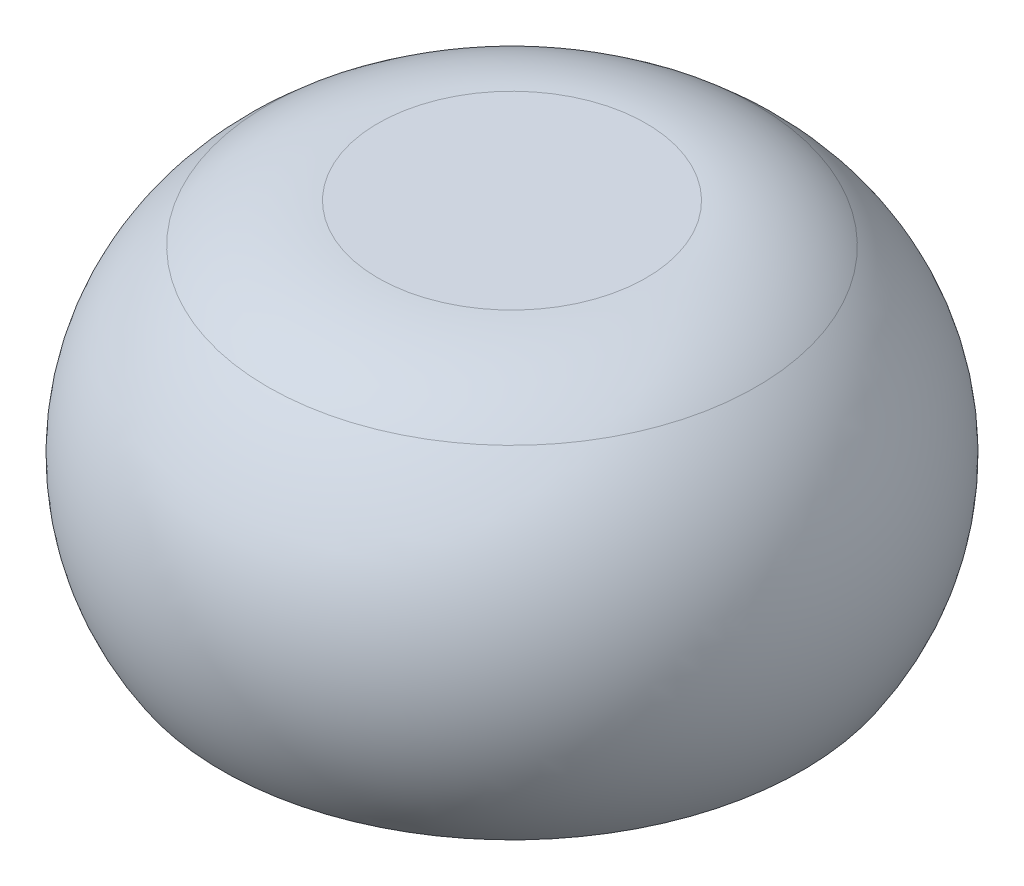
ISO-10303-21;
HEADER;
FILE_DESCRIPTION(('STEP AP214'),'2;1');
FILE_NAME('part.step','',(''),(''),'','','');
FILE_SCHEMA(('AUTOMOTIVE_DESIGN { 1 0 10303 214 1 1 1 1 }'));
ENDSEC;
DATA;
#1=APPLICATION_CONTEXT('core data for automotive mechanical design processes');
#2=APPLICATION_PROTOCOL_DEFINITION('international standard','automotive_design',2000,#1);
#3=PRODUCT_CONTEXT('',#1,'mechanical');
#4=PRODUCT('Part','Part','',(#3));
#5=PRODUCT_RELATED_PRODUCT_CATEGORY('part','',(#4));
#6=PRODUCT_DEFINITION_FORMATION('','',#4);
#7=PRODUCT_DEFINITION_CONTEXT('part definition',#1,'design');
#8=PRODUCT_DEFINITION('design','',#6,#7);
#9=PRODUCT_DEFINITION_SHAPE('','',#8);
#10=(LENGTH_UNIT() NAMED_UNIT(*) SI_UNIT(.MILLI.,.METRE.));
#11=(NAMED_UNIT(*) PLANE_ANGLE_UNIT() SI_UNIT($,.RADIAN.));
#12=(NAMED_UNIT(*) SI_UNIT($,.STERADIAN.) SOLID_ANGLE_UNIT());
#13=UNCERTAINTY_MEASURE_WITH_UNIT(LENGTH_MEASURE(1.E-05),#10,'distance_accuracy_value','');
#14=(GEOMETRIC_REPRESENTATION_CONTEXT(3) GLOBAL_UNCERTAINTY_ASSIGNED_CONTEXT((#13)) GLOBAL_UNIT_ASSIGNED_CONTEXT((#10,
#11,#12)) REPRESENTATION_CONTEXT('',''));
#15=CARTESIAN_POINT('',(0.,0.,0.));
#16=DIRECTION('',(0.,0.,1.));
#17=DIRECTION('',(1.,0.,0.));
#18=AXIS2_PLACEMENT_3D('',#15,#16,#17);
#19=CARTESIAN_POINT('',(0.,8.35391052434009,0.));
#20=DIRECTION('',(0.,-1.,0.));
#21=DIRECTION('',(0.,0.,-1.));
#22=AXIS2_PLACEMENT_3D('',#19,#20,#21);
#23=CYLINDRICAL_SURFACE('',#22,2.6);
#24=CARTESIAN_POINT('',(0.,0.7,0.));
#25=DIRECTION('',(0.,-1.,0.));
#26=DIRECTION('',(0.,0.,-1.));
#27=AXIS2_PLACEMENT_3D('',#24,#25,#26);
#28=CIRCLE('',#27,2.6);
#29=CARTESIAN_POINT('',(0.,0.7,-2.6));
#30=VERTEX_POINT('',#29);
#31=EDGE_CURVE('E12',#30,#30,#28,.F.);
#32=ORIENTED_EDGE('',*,*,#31,.F.);
#33=EDGE_LOOP('',(#32));
#34=FACE_BOUND('',#33,.T.);
#35=CARTESIAN_POINT('',(0.,0.,0.));
#36=DIRECTION('',(0.,-1.,0.));
#37=DIRECTION('',(0.,0.,-1.));
#38=AXIS2_PLACEMENT_3D('',#35,#36,#37);
#39=CIRCLE('',#38,2.6);
#40=CARTESIAN_POINT('',(0.,0.,-2.6));
#41=VERTEX_POINT('',#40);
#42=EDGE_CURVE('E52',#41,#41,#39,.T.);
#43=ORIENTED_EDGE('',*,*,#42,.F.);
#44=EDGE_LOOP('',(#43));
#45=FACE_BOUND('',#44,.T.);
#46=ADVANCED_FACE('F46',(#34,#45),#23,.T.);
#47=CARTESIAN_POINT('',(0.,0.,0.));
#48=DIRECTION('',(0.,-1.,0.));
#49=DIRECTION('',(0.,0.,-1.));
#50=AXIS2_PLACEMENT_3D('',#47,#48,#49);
#51=PLANE('',#50);
#52=ORIENTED_EDGE('',*,*,#42,.T.);
#53=EDGE_LOOP('',(#52));
#54=FACE_BOUND('',#53,.T.);
#55=ADVANCED_FACE('F58',(#54),#51,.T.);
#56=CARTESIAN_POINT('',(0.,0.7,0.));
#57=DIRECTION('',(0.,-1.,0.));
#58=DIRECTION('',(0.,0.,-1.));
#59=AXIS2_PLACEMENT_3D('',#56,#57,#58);
#60=PLANE('',#59);
#61=ORIENTED_EDGE('',*,*,#31,.T.);
#62=EDGE_LOOP('',(#61));
#63=FACE_BOUND('',#62,.T.);
#64=ADVANCED_FACE('F65',(#63),#60,.F.);
#65=CLOSED_SHELL('',(#46,#55,#64));
#66=MANIFOLD_SOLID_BREP('B2_NOT_SHOWN',#65);
#67=CARTESIAN_POINT('',(0.,0.,0.));
#68=DIRECTION('',(0.,1.,0.));
#69=DIRECTION('',(0.,0.,1.));
#70=AXIS2_PLACEMENT_3D('',#67,#68,#69);
#71=PLANE('',#70);
#72=CARTESIAN_POINT('',(0.,0.,0.));
#73=DIRECTION('',(0.,1.,0.));
#74=DIRECTION('',(0.,0.,1.));
#75=AXIS2_PLACEMENT_3D('',#72,#73,#74);
#76=CIRCLE('',#75,3.40000000000001);
#77=CARTESIAN_POINT('',(0.,0.,3.40000000000001));
#78=VERTEX_POINT('',#77);
#79=EDGE_CURVE('E162',#78,#78,#76,.T.);
#80=ORIENTED_EDGE('',*,*,#79,.T.);
#81=EDGE_LOOP('',(#80));
#82=FACE_BOUND('',#81,.T.);
#83=CARTESIAN_POINT('',(0.,0.,0.));
#84=DIRECTION('',(0.,-1.,0.));
#85=DIRECTION('',(0.,0.,-1.));
#86=AXIS2_PLACEMENT_3D('',#83,#84,#85);
#87=CIRCLE('',#86,5.);
#88=CARTESIAN_POINT('',(0.,0.,-5.));
#89=VERTEX_POINT('',#88);
#90=EDGE_CURVE('E208',#89,#89,#87,.T.);
#91=ORIENTED_EDGE('',*,*,#90,.T.);
#92=EDGE_LOOP('',(#91));
#93=FACE_BOUND('',#92,.T.);
#94=ADVANCED_FACE('F88',(#82,#93),#71,.F.);
#95=CARTESIAN_POINT('',(0.,1.,0.));
#96=DIRECTION('',(0.,-1.,0.));
#97=DIRECTION('',(0.,0.,-1.));
#98=AXIS2_PLACEMENT_3D('',#95,#96,#97);
#99=CYLINDRICAL_SURFACE('',#98,3.2);
#100=CARTESIAN_POINT('',(0.,0.200000000000004,0.));
#101=DIRECTION('',(0.,1.,0.));
#102=DIRECTION('',(0.,0.,1.));
#103=AXIS2_PLACEMENT_3D('',#100,#101,#102);
#104=CIRCLE('',#103,3.2);
#105=CARTESIAN_POINT('',(0.,0.200000000000004,3.2));
#106=VERTEX_POINT('',#105);
#107=EDGE_CURVE('E137',#106,#106,#104,.F.);
#108=ORIENTED_EDGE('',*,*,#107,.T.);
#109=EDGE_LOOP('',(#108));
#110=FACE_BOUND('',#109,.T.);
#111=CARTESIAN_POINT('',(0.,1.,0.));
#112=DIRECTION('',(0.,-1.,0.));
#113=DIRECTION('',(0.,0.,-1.));
#114=AXIS2_PLACEMENT_3D('',#111,#112,#113);
#115=CIRCLE('',#114,3.2);
#116=CARTESIAN_POINT('',(0.,1.,-3.2));
#117=VERTEX_POINT('',#116);
#118=EDGE_CURVE('E207',#117,#117,#115,.T.);
#119=ORIENTED_EDGE('',*,*,#118,.F.);
#120=EDGE_LOOP('',(#119));
#121=FACE_BOUND('',#120,.T.);
#122=ADVANCED_FACE('F181',(#110,#121),#99,.F.);
#123=CARTESIAN_POINT('',(0.,1.,0.));
#124=DIRECTION('',(0.,-1.,0.));
#125=DIRECTION('',(0.,0.,-1.));
#126=AXIS2_PLACEMENT_3D('',#123,#124,#125);
#127=PLANE('',#126);
#128=DIRECTION('',(1.,0.,0.));
#129=VECTOR('',#128,1.);
#130=CARTESIAN_POINT('',(-1.65,1.,-1.65));
#131=LINE('',#130,#129);
#132=CARTESIAN_POINT('',(-1.65,1.,-1.65));
#133=VERTEX_POINT('',#132);
#134=CARTESIAN_POINT('',(1.65,1.,-1.65));
#135=VERTEX_POINT('',#134);
#136=EDGE_CURVE('E147',#133,#135,#131,.T.);
#137=ORIENTED_EDGE('',*,*,#136,.F.);
#138=DIRECTION('',(0.,0.,-1.));
#139=VECTOR('',#138,1.);
#140=CARTESIAN_POINT('',(-1.65,1.,1.65));
#141=LINE('',#140,#139);
#142=CARTESIAN_POINT('',(-1.65,1.,1.65));
#143=VERTEX_POINT('',#142);
#144=EDGE_CURVE('E103',#143,#133,#141,.T.);
#145=ORIENTED_EDGE('',*,*,#144,.F.);
#146=DIRECTION('',(-1.,0.,0.));
#147=VECTOR('',#146,1.);
#148=CARTESIAN_POINT('',(-1.65,1.,1.65));
#149=LINE('',#148,#147);
#150=CARTESIAN_POINT('',(1.65,1.,1.65));
#151=VERTEX_POINT('',#150);
#152=EDGE_CURVE('E127',#151,#143,#149,.T.);
#153=ORIENTED_EDGE('',*,*,#152,.F.);
#154=DIRECTION('',(0.,0.,1.));
#155=VECTOR('',#154,1.);
#156=CARTESIAN_POINT('',(1.65,1.,1.65));
#157=LINE('',#156,#155);
#158=EDGE_CURVE('E131',#135,#151,#157,.T.);
#159=ORIENTED_EDGE('',*,*,#158,.F.);
#160=EDGE_LOOP('',(#137,#145,#153,#159));
#161=FACE_BOUND('',#160,.T.);
#162=ORIENTED_EDGE('',*,*,#118,.T.);
#163=EDGE_LOOP('',(#162));
#164=FACE_BOUND('',#163,.T.);
#165=ADVANCED_FACE('F129',(#161,#164),#127,.T.);
#166=CARTESIAN_POINT('',(0.,4.5,0.));
#167=DIRECTION('',(0.,1.,0.));
#168=DIRECTION('',(0.,0.,-1.));
#169=AXIS2_PLACEMENT_3D('',#166,#167,#168);
#170=PLANE('',#169);
#171=DIRECTION('',(0.,0.,-1.));
#172=VECTOR('',#171,1.);
#173=CARTESIAN_POINT('',(1.65,4.5,1.65));
#174=LINE('',#173,#172);
#175=CARTESIAN_POINT('',(1.65,4.5,1.65));
#176=VERTEX_POINT('',#175);
#177=CARTESIAN_POINT('',(1.65,4.5,-1.65));
#178=VERTEX_POINT('',#177);
#179=EDGE_CURVE('E146',#176,#178,#174,.T.);
#180=ORIENTED_EDGE('',*,*,#179,.F.);
#181=DIRECTION('',(1.,0.,0.));
#182=VECTOR('',#181,1.);
#183=CARTESIAN_POINT('',(-1.65,4.5,1.65));
#184=LINE('',#183,#182);
#185=CARTESIAN_POINT('',(-1.65,4.5,1.65));
#186=VERTEX_POINT('',#185);
#187=EDGE_CURVE('E151',#186,#176,#184,.T.);
#188=ORIENTED_EDGE('',*,*,#187,.F.);
#189=DIRECTION('',(0.,0.,1.));
#190=VECTOR('',#189,1.);
#191=CARTESIAN_POINT('',(-1.65,4.5,1.65));
#192=LINE('',#191,#190);
#193=CARTESIAN_POINT('',(-1.65,4.5,-1.65));
#194=VERTEX_POINT('',#193);
#195=EDGE_CURVE('E156',#194,#186,#192,.T.);
#196=ORIENTED_EDGE('',*,*,#195,.F.);
#197=DIRECTION('',(-1.,0.,0.));
#198=VECTOR('',#197,1.);
#199=CARTESIAN_POINT('',(-1.65,4.5,-1.65));
#200=LINE('',#199,#198);
#201=EDGE_CURVE('E111',#178,#194,#200,.T.);
#202=ORIENTED_EDGE('',*,*,#201,.F.);
#203=EDGE_LOOP('',(#180,#188,#196,#202));
#204=FACE_BOUND('',#203,.T.);
#205=ADVANCED_FACE('F223',(#204),#170,.F.);
#206=CARTESIAN_POINT('',(-1.65,4.5,1.65));
#207=DIRECTION('',(0.,0.,-1.));
#208=DIRECTION('',(-1.,0.,0.));
#209=AXIS2_PLACEMENT_3D('',#206,#207,#208);
#210=PLANE('',#209);
#211=DIRECTION('',(0.,-1.,0.));
#212=VECTOR('',#211,1.);
#213=CARTESIAN_POINT('',(1.65,4.5,1.65));
#214=LINE('',#213,#212);
#215=EDGE_CURVE('E144',#176,#151,#214,.T.);
#216=ORIENTED_EDGE('',*,*,#215,.T.);
#217=ORIENTED_EDGE('',*,*,#152,.T.);
#218=DIRECTION('',(0.,-1.,0.));
#219=VECTOR('',#218,1.);
#220=CARTESIAN_POINT('',(-1.65,4.5,1.65));
#221=LINE('',#220,#219);
#222=EDGE_CURVE('E152',#186,#143,#221,.T.);
#223=ORIENTED_EDGE('',*,*,#222,.F.);
#224=ORIENTED_EDGE('',*,*,#187,.T.);
#225=EDGE_LOOP('',(#216,#217,#223,#224));
#226=FACE_BOUND('',#225,.T.);
#227=ADVANCED_FACE('F149',(#226),#210,.T.);
#228=CARTESIAN_POINT('',(-1.65,4.5,1.65));
#229=DIRECTION('',(1.,0.,0.));
#230=DIRECTION('',(0.,0.,-1.));
#231=AXIS2_PLACEMENT_3D('',#228,#229,#230);
#232=PLANE('',#231);
#233=ORIENTED_EDGE('',*,*,#222,.T.);
#234=ORIENTED_EDGE('',*,*,#144,.T.);
#235=DIRECTION('',(0.,-1.,0.));
#236=VECTOR('',#235,1.);
#237=CARTESIAN_POINT('',(-1.65,4.5,-1.65));
#238=LINE('',#237,#236);
#239=EDGE_CURVE('E154',#194,#133,#238,.T.);
#240=ORIENTED_EDGE('',*,*,#239,.F.);
#241=ORIENTED_EDGE('',*,*,#195,.T.);
#242=EDGE_LOOP('',(#233,#234,#240,#241));
#243=FACE_BOUND('',#242,.T.);
#244=ADVANCED_FACE('F222',(#243),#232,.T.);
#245=CARTESIAN_POINT('',(-1.65,4.5,-1.65));
#246=DIRECTION('',(0.,0.,1.));
#247=DIRECTION('',(1.,0.,0.));
#248=AXIS2_PLACEMENT_3D('',#245,#246,#247);
#249=PLANE('',#248);
#250=ORIENTED_EDGE('',*,*,#239,.T.);
#251=ORIENTED_EDGE('',*,*,#136,.T.);
#252=DIRECTION('',(0.,-1.,0.));
#253=VECTOR('',#252,1.);
#254=CARTESIAN_POINT('',(1.65,4.5,-1.65));
#255=LINE('',#254,#253);
#256=EDGE_CURVE('E138',#178,#135,#255,.T.);
#257=ORIENTED_EDGE('',*,*,#256,.F.);
#258=ORIENTED_EDGE('',*,*,#201,.T.);
#259=EDGE_LOOP('',(#250,#251,#257,#258));
#260=FACE_BOUND('',#259,.T.);
#261=ADVANCED_FACE('F200',(#260),#249,.T.);
#262=CARTESIAN_POINT('',(1.65,4.5,1.65));
#263=DIRECTION('',(-1.,0.,0.));
#264=DIRECTION('',(0.,0.,1.));
#265=AXIS2_PLACEMENT_3D('',#262,#263,#264);
#266=PLANE('',#265);
#267=ORIENTED_EDGE('',*,*,#256,.T.);
#268=ORIENTED_EDGE('',*,*,#158,.T.);
#269=ORIENTED_EDGE('',*,*,#215,.F.);
#270=ORIENTED_EDGE('',*,*,#179,.T.);
#271=EDGE_LOOP('',(#267,#268,#269,#270));
#272=FACE_BOUND('',#271,.T.);
#273=ADVANCED_FACE('F143',(#272),#266,.T.);
#274=CARTESIAN_POINT('',(0.,0.200000000000004,0.));
#275=DIRECTION('',(0.,-1.,0.));
#276=DIRECTION('',(0.,0.,-1.));
#277=AXIS2_PLACEMENT_3D('',#274,#275,#276);
#278=CONICAL_SURFACE('',#277,3.2,0.785398163397456);
#279=ORIENTED_EDGE('',*,*,#79,.F.);
#280=EDGE_LOOP('',(#279));
#281=FACE_BOUND('',#280,.T.);
#282=ORIENTED_EDGE('',*,*,#107,.F.);
#283=EDGE_LOOP('',(#282));
#284=FACE_BOUND('',#283,.T.);
#285=ADVANCED_FACE('F193',(#281,#284),#278,.F.);
#286=CARTESIAN_POINT('',(0.,2.22540333075852,0.));
#287=DIRECTION('',(0.,-1.,0.));
#288=DIRECTION('',(0.,0.,-1.));
#289=AXIS2_PLACEMENT_3D('',#286,#287,#288);
#290=DEGENERATE_TOROIDAL_SURFACE('',#289,1.67620999227555,4.,.T.);
#291=CARTESIAN_POINT('',(0.,5.32379000772445,0.));
#292=DIRECTION('',(0.,-1.,0.));
#293=DIRECTION('',(0.,0.,-1.));
#294=AXIS2_PLACEMENT_3D('',#291,#292,#293);
#295=CIRCLE('',#294,4.20603212041025);
#296=CARTESIAN_POINT('',(0.,5.32379000772445,-4.20603212041025));
#297=VERTEX_POINT('',#296);
#298=EDGE_CURVE('E96',#297,#297,#295,.T.);
#299=ORIENTED_EDGE('',*,*,#298,.T.);
#300=EDGE_LOOP('',(#299));
#301=FACE_BOUND('',#300,.T.);
#302=ORIENTED_EDGE('',*,*,#90,.F.);
#303=EDGE_LOOP('',(#302));
#304=FACE_BOUND('',#303,.T.);
#305=ADVANCED_FACE('F167',(#301,#304),#290,.T.);
#306=CARTESIAN_POINT('',(0.,6.,0.));
#307=DIRECTION('',(0.,1.,0.));
#308=DIRECTION('',(0.,0.,1.));
#309=AXIS2_PLACEMENT_3D('',#306,#307,#308);
#310=PLANE('',#309);
#311=CARTESIAN_POINT('',(0.,6.,0.));
#312=DIRECTION('',(0.,1.,0.));
#313=DIRECTION('',(0.,0.,1.));
#314=AXIS2_PLACEMENT_3D('',#311,#312,#313);
#315=CIRCLE('',#314,2.30866552430923);
#316=CARTESIAN_POINT('',(0.,6.,2.30866552430923));
#317=VERTEX_POINT('',#316);
#318=EDGE_CURVE('E44',#317,#317,#315,.T.);
#319=ORIENTED_EDGE('',*,*,#318,.T.);
#320=EDGE_LOOP('',(#319));
#321=FACE_BOUND('',#320,.T.);
#322=ADVANCED_FACE('F171',(#321),#310,.T.);
#323=CARTESIAN_POINT('',(0.,3.,0.));
#324=DIRECTION('',(0.,1.,0.));
#325=DIRECTION('',(0.,0.,1.));
#326=AXIS2_PLACEMENT_3D('',#323,#324,#325);
#327=DEGENERATE_TOROIDAL_SURFACE('',#326,2.30866552430923,3.,.T.);
#328=ORIENTED_EDGE('',*,*,#318,.F.);
#329=EDGE_LOOP('',(#328));
#330=FACE_BOUND('',#329,.T.);
#331=ORIENTED_EDGE('',*,*,#298,.F.);
#332=EDGE_LOOP('',(#331));
#333=FACE_BOUND('',#332,.T.);
#334=ADVANCED_FACE('F90',(#330,#333),#327,.T.);
#335=CLOSED_SHELL('',(#94,#122,#165,#205,#227,#244,#261,#273,#285,#305,#322,#334));
#336=MANIFOLD_SOLID_BREP('B7',#335);
#337=ADVANCED_BREP_SHAPE_REPRESENTATION('',(#18,#66,#336),#14);
#338=SHAPE_DEFINITION_REPRESENTATION(#9,#337);
ENDSEC;
END-ISO-10303-21;
